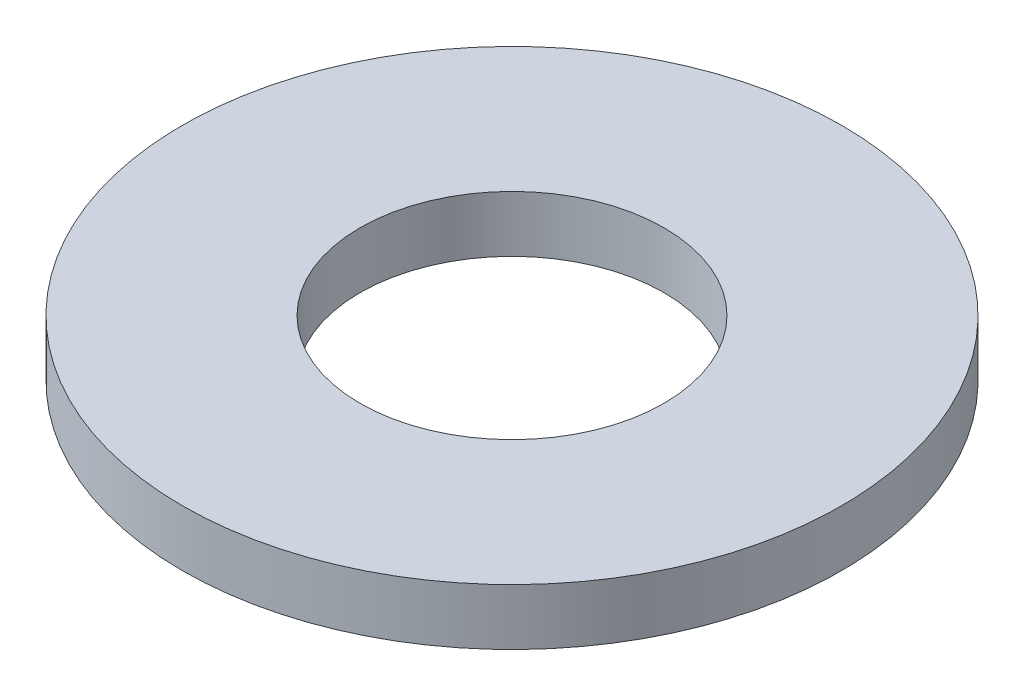
ISO-10303-21;
HEADER;
FILE_DESCRIPTION(('STEP AP214'),'2;1');
FILE_NAME('part.step','',(''),(''),'','','');
FILE_SCHEMA(('AUTOMOTIVE_DESIGN { 1 0 10303 214 1 1 1 1 }'));
ENDSEC;
DATA;
#1=APPLICATION_CONTEXT('core data for automotive mechanical design processes');
#2=APPLICATION_PROTOCOL_DEFINITION('international standard','automotive_design',2000,#1);
#3=PRODUCT_CONTEXT('',#1,'mechanical');
#4=PRODUCT('Part','Part','',(#3));
#5=PRODUCT_RELATED_PRODUCT_CATEGORY('part','',(#4));
#6=PRODUCT_DEFINITION_FORMATION('','',#4);
#7=PRODUCT_DEFINITION_CONTEXT('part definition',#1,'design');
#8=PRODUCT_DEFINITION('design','',#6,#7);
#9=PRODUCT_DEFINITION_SHAPE('','',#8);
#10=(LENGTH_UNIT() NAMED_UNIT(*) SI_UNIT(.MILLI.,.METRE.));
#11=(NAMED_UNIT(*) PLANE_ANGLE_UNIT() SI_UNIT($,.RADIAN.));
#12=(NAMED_UNIT(*) SI_UNIT($,.STERADIAN.) SOLID_ANGLE_UNIT());
#13=UNCERTAINTY_MEASURE_WITH_UNIT(LENGTH_MEASURE(1.E-05),#10,'distance_accuracy_value','');
#14=(GEOMETRIC_REPRESENTATION_CONTEXT(3) GLOBAL_UNCERTAINTY_ASSIGNED_CONTEXT((#13)) GLOBAL_UNIT_ASSIGNED_CONTEXT((#10,
#11,#12)) REPRESENTATION_CONTEXT('',''));
#15=CARTESIAN_POINT('',(0.,0.,0.));
#16=DIRECTION('',(0.,0.,1.));
#17=DIRECTION('',(1.,0.,0.));
#18=AXIS2_PLACEMENT_3D('',#15,#16,#17);
#19=CARTESIAN_POINT('',(0.,0.8128,0.));
#20=DIRECTION('',(0.,1.,0.));
#21=DIRECTION('',(0.,0.,-1.));
#22=AXIS2_PLACEMENT_3D('',#19,#20,#21);
#23=PLANE('',#22);
#24=CARTESIAN_POINT('',(0.,0.8128,0.));
#25=DIRECTION('',(0.,1.,0.));
#26=DIRECTION('',(0.,0.,1.));
#27=AXIS2_PLACEMENT_3D('',#24,#25,#26);
#28=CIRCLE('',#27,2.1971);
#29=CARTESIAN_POINT('',(0.,0.8128,2.1971));
#30=VERTEX_POINT('',#29);
#31=EDGE_CURVE('E44',#30,#30,#28,.T.);
#32=ORIENTED_EDGE('',*,*,#31,.F.);
#33=EDGE_LOOP('',(#32));
#34=FACE_BOUND('',#33,.T.);
#35=CARTESIAN_POINT('',(0.,0.8128,0.));
#36=DIRECTION('',(0.,1.,0.));
#37=DIRECTION('',(0.,0.,1.));
#38=AXIS2_PLACEMENT_3D('',#35,#36,#37);
#39=CIRCLE('',#38,4.7625);
#40=CARTESIAN_POINT('',(0.,0.8128,4.7625));
#41=VERTEX_POINT('',#40);
#42=EDGE_CURVE('E35',#41,#41,#39,.T.);
#43=ORIENTED_EDGE('',*,*,#42,.T.);
#44=EDGE_LOOP('',(#43));
#45=FACE_BOUND('',#44,.T.);
#46=ADVANCED_FACE('F32',(#34,#45),#23,.T.);
#47=CARTESIAN_POINT('',(0.,0.8128,0.));
#48=DIRECTION('',(0.,-1.,0.));
#49=DIRECTION('',(0.,0.,1.));
#50=AXIS2_PLACEMENT_3D('',#47,#48,#49);
#51=CYLINDRICAL_SURFACE('',#50,4.7625);
#52=ORIENTED_EDGE('',*,*,#42,.F.);
#53=EDGE_LOOP('',(#52));
#54=FACE_BOUND('',#53,.T.);
#55=CARTESIAN_POINT('',(0.,0.,0.));
#56=DIRECTION('',(0.,1.,0.));
#57=DIRECTION('',(0.,0.,1.));
#58=AXIS2_PLACEMENT_3D('',#55,#56,#57);
#59=CIRCLE('',#58,4.7625);
#60=CARTESIAN_POINT('',(0.,0.,4.7625));
#61=VERTEX_POINT('',#60);
#62=EDGE_CURVE('E39',#61,#61,#59,.F.);
#63=ORIENTED_EDGE('',*,*,#62,.F.);
#64=EDGE_LOOP('',(#63));
#65=FACE_BOUND('',#64,.T.);
#66=ADVANCED_FACE('F53',(#54,#65),#51,.T.);
#67=CARTESIAN_POINT('',(0.,0.8128,0.));
#68=DIRECTION('',(0.,-1.,0.));
#69=DIRECTION('',(0.,0.,1.));
#70=AXIS2_PLACEMENT_3D('',#67,#68,#69);
#71=CYLINDRICAL_SURFACE('',#70,2.1971);
#72=CARTESIAN_POINT('',(0.,0.,0.));
#73=DIRECTION('',(0.,1.,0.));
#74=DIRECTION('',(0.,0.,1.));
#75=AXIS2_PLACEMENT_3D('',#72,#73,#74);
#76=CIRCLE('',#75,2.1971);
#77=CARTESIAN_POINT('',(0.,0.,2.1971));
#78=VERTEX_POINT('',#77);
#79=EDGE_CURVE('E10',#78,#78,#76,.T.);
#80=ORIENTED_EDGE('',*,*,#79,.F.);
#81=EDGE_LOOP('',(#80));
#82=FACE_BOUND('',#81,.T.);
#83=ORIENTED_EDGE('',*,*,#31,.T.);
#84=EDGE_LOOP('',(#83));
#85=FACE_BOUND('',#84,.T.);
#86=ADVANCED_FACE('F56',(#82,#85),#71,.F.);
#87=CARTESIAN_POINT('',(0.,0.,0.));
#88=DIRECTION('',(0.,1.,0.));
#89=DIRECTION('',(0.,0.,-1.));
#90=AXIS2_PLACEMENT_3D('',#87,#88,#89);
#91=PLANE('',#90);
#92=ORIENTED_EDGE('',*,*,#79,.T.);
#93=EDGE_LOOP('',(#92));
#94=FACE_BOUND('',#93,.T.);
#95=ORIENTED_EDGE('',*,*,#62,.T.);
#96=EDGE_LOOP('',(#95));
#97=FACE_BOUND('',#96,.T.);
#98=ADVANCED_FACE('F59',(#94,#97),#91,.F.);
#99=CLOSED_SHELL('',(#46,#66,#86,#98));
#100=MANIFOLD_SOLID_BREP('B2',#99);
#101=ADVANCED_BREP_SHAPE_REPRESENTATION('',(#18,#100),#14);
#102=SHAPE_DEFINITION_REPRESENTATION(#9,#101);
ENDSEC;
END-ISO-10303-21;
